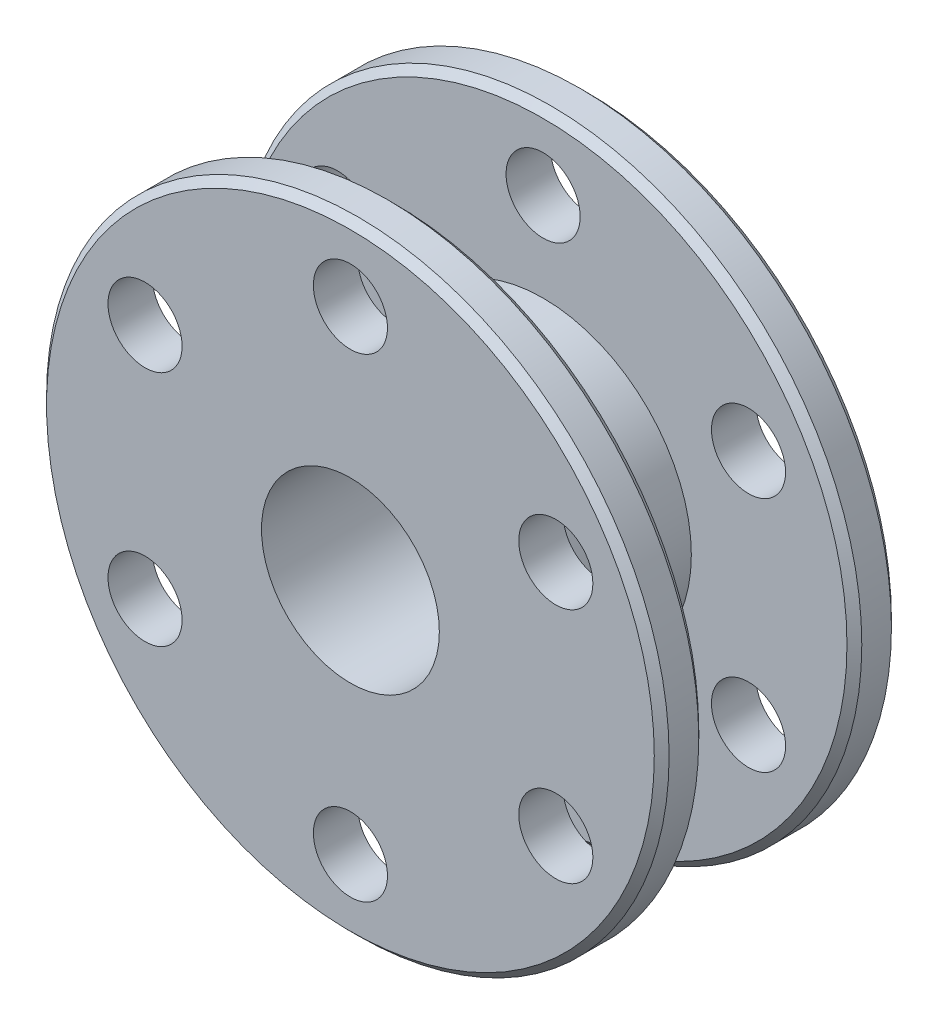
ISO-10303-21;
HEADER;
FILE_DESCRIPTION(('STEP AP214'),'2;1');
FILE_NAME('part.step','',(''),(''),'','','');
FILE_SCHEMA(('AUTOMOTIVE_DESIGN { 1 0 10303 214 1 1 1 1 }'));
ENDSEC;
DATA;
#1=APPLICATION_CONTEXT('core data for automotive mechanical design processes');
#2=APPLICATION_PROTOCOL_DEFINITION('international standard','automotive_design',2000,#1);
#3=PRODUCT_CONTEXT('',#1,'mechanical');
#4=PRODUCT('Part','Part','',(#3));
#5=PRODUCT_RELATED_PRODUCT_CATEGORY('part','',(#4));
#6=PRODUCT_DEFINITION_FORMATION('','',#4);
#7=PRODUCT_DEFINITION_CONTEXT('part definition',#1,'design');
#8=PRODUCT_DEFINITION('design','',#6,#7);
#9=PRODUCT_DEFINITION_SHAPE('','',#8);
#10=(LENGTH_UNIT() NAMED_UNIT(*) SI_UNIT(.MILLI.,.METRE.));
#11=(NAMED_UNIT(*) PLANE_ANGLE_UNIT() SI_UNIT($,.RADIAN.));
#12=(NAMED_UNIT(*) SI_UNIT($,.STERADIAN.) SOLID_ANGLE_UNIT());
#13=UNCERTAINTY_MEASURE_WITH_UNIT(LENGTH_MEASURE(1.E-05),#10,'distance_accuracy_value','');
#14=(GEOMETRIC_REPRESENTATION_CONTEXT(3) GLOBAL_UNCERTAINTY_ASSIGNED_CONTEXT((#13)) GLOBAL_UNIT_ASSIGNED_CONTEXT((#10,
#11,#12)) REPRESENTATION_CONTEXT('',''));
#15=CARTESIAN_POINT('',(0.,0.,0.));
#16=DIRECTION('',(0.,0.,1.));
#17=DIRECTION('',(1.,0.,0.));
#18=AXIS2_PLACEMENT_3D('',#15,#16,#17);
#19=CARTESIAN_POINT('',(0.,0.,-4.));
#20=DIRECTION('',(0.,0.,1.));
#21=DIRECTION('',(1.,0.,0.));
#22=AXIS2_PLACEMENT_3D('',#19,#20,#21);
#23=CYLINDRICAL_SURFACE('',#22,10.5);
#24=CARTESIAN_POINT('',(0.,0.,-2.75));
#25=DIRECTION('',(0.,0.,1.));
#26=DIRECTION('',(1.,0.,0.));
#27=AXIS2_PLACEMENT_3D('',#24,#25,#26);
#28=CIRCLE('',#27,10.5);
#29=CARTESIAN_POINT('',(10.5,0.,-2.75));
#30=VERTEX_POINT('',#29);
#31=EDGE_CURVE('E125',#30,#30,#28,.F.);
#32=ORIENTED_EDGE('',*,*,#31,.T.);
#33=EDGE_LOOP('',(#32));
#34=FACE_BOUND('',#33,.T.);
#35=CARTESIAN_POINT('',(0.,0.,-3.75));
#36=DIRECTION('',(0.,0.,1.));
#37=DIRECTION('',(1.,0.,0.));
#38=AXIS2_PLACEMENT_3D('',#35,#36,#37);
#39=CIRCLE('',#38,10.5);
#40=CARTESIAN_POINT('',(10.5,0.,-3.75));
#41=VERTEX_POINT('',#40);
#42=EDGE_CURVE('E119',#41,#41,#39,.T.);
#43=ORIENTED_EDGE('',*,*,#42,.T.);
#44=EDGE_LOOP('',(#43));
#45=FACE_BOUND('',#44,.T.);
#46=ADVANCED_FACE('F39',(#34,#45),#23,.T.);
#47=CARTESIAN_POINT('',(0.,0.,2.75));
#48=DIRECTION('',(0.,0.,1.));
#49=DIRECTION('',(1.,0.,0.));
#50=AXIS2_PLACEMENT_3D('',#47,#48,#49);
#51=CIRCLE('',#50,10.5);
#52=CARTESIAN_POINT('',(10.5,0.,2.75));
#53=VERTEX_POINT('',#52);
#54=EDGE_CURVE('E11',#53,#53,#51,.T.);
#55=ORIENTED_EDGE('',*,*,#54,.T.);
#56=EDGE_LOOP('',(#55));
#57=FACE_BOUND('',#56,.T.);
#58=CARTESIAN_POINT('',(0.,0.,3.75));
#59=DIRECTION('',(0.,0.,1.));
#60=DIRECTION('',(1.,0.,0.));
#61=AXIS2_PLACEMENT_3D('',#58,#59,#60);
#62=CIRCLE('',#61,10.5);
#63=CARTESIAN_POINT('',(10.5,0.,3.75));
#64=VERTEX_POINT('',#63);
#65=EDGE_CURVE('E116',#64,#64,#62,.F.);
#66=ORIENTED_EDGE('',*,*,#65,.T.);
#67=EDGE_LOOP('',(#66));
#68=FACE_BOUND('',#67,.T.);
#69=ADVANCED_FACE('F141',(#57,#68),#23,.T.);
#70=CARTESIAN_POINT('',(0.,0.,-4.));
#71=DIRECTION('',(0.,0.,1.));
#72=DIRECTION('',(1.,0.,0.));
#73=AXIS2_PLACEMENT_3D('',#70,#71,#72);
#74=PLANE('',#73);
#75=CARTESIAN_POINT('',(0.,8.,-4.));
#76=DIRECTION('',(0.,0.,1.));
#77=DIRECTION('',(1.,0.,0.));
#78=AXIS2_PLACEMENT_3D('',#75,#76,#77);
#79=CIRCLE('',#78,1.25);
#80=CARTESIAN_POINT('',(1.25,8.,-4.));
#81=VERTEX_POINT('',#80);
#82=EDGE_CURVE('E61',#81,#81,#79,.T.);
#83=ORIENTED_EDGE('',*,*,#82,.T.);
#84=EDGE_LOOP('',(#83));
#85=FACE_BOUND('',#84,.T.);
#86=CARTESIAN_POINT('',(-6.92820323027506,3.99999999999921,-4.));
#87=DIRECTION('',(0.,0.,1.));
#88=DIRECTION('',(1.,0.,0.));
#89=AXIS2_PLACEMENT_3D('',#86,#87,#88);
#90=CIRCLE('',#89,1.25000000000076);
#91=CARTESIAN_POINT('',(-5.6782032302743,3.99999999999921,-4.));
#92=VERTEX_POINT('',#91);
#93=EDGE_CURVE('E444',#92,#92,#90,.T.);
#94=ORIENTED_EDGE('',*,*,#93,.T.);
#95=EDGE_LOOP('',(#94));
#96=FACE_BOUND('',#95,.T.);
#97=CARTESIAN_POINT('',(-6.92820323027415,-4.00000000000079,-4.));
#98=DIRECTION('',(0.,0.,1.));
#99=DIRECTION('',(1.,0.,0.));
#100=AXIS2_PLACEMENT_3D('',#97,#98,#99);
#101=CIRCLE('',#100,1.25000000000161);
#102=CARTESIAN_POINT('',(-5.67820323027254,-4.00000000000079,-4.));
#103=VERTEX_POINT('',#102);
#104=EDGE_CURVE('E447',#103,#103,#101,.T.);
#105=ORIENTED_EDGE('',*,*,#104,.T.);
#106=EDGE_LOOP('',(#105));
#107=FACE_BOUND('',#106,.T.);
#108=CARTESIAN_POINT('',(1.8160502512279E-12,-8.,-4.));
#109=DIRECTION('',(0.,0.,1.));
#110=DIRECTION('',(1.,0.,0.));
#111=AXIS2_PLACEMENT_3D('',#108,#109,#110);
#112=CIRCLE('',#111,1.25000000000179);
#113=CARTESIAN_POINT('',(1.25000000000361,-8.,-4.));
#114=VERTEX_POINT('',#113);
#115=EDGE_CURVE('E441',#114,#114,#112,.T.);
#116=ORIENTED_EDGE('',*,*,#115,.T.);
#117=EDGE_LOOP('',(#116));
#118=FACE_BOUND('',#117,.T.);
#119=CARTESIAN_POINT('',(6.92820323027687,-3.99999999999921,-4.));
#120=DIRECTION('',(0.,0.,1.));
#121=DIRECTION('',(1.,0.,0.));
#122=AXIS2_PLACEMENT_3D('',#119,#120,#121);
#123=CIRCLE('',#122,1.25000000000111);
#124=CARTESIAN_POINT('',(8.17820323027798,-3.99999999999921,-4.));
#125=VERTEX_POINT('',#124);
#126=EDGE_CURVE('E436',#125,#125,#123,.T.);
#127=ORIENTED_EDGE('',*,*,#126,.T.);
#128=EDGE_LOOP('',(#127));
#129=FACE_BOUND('',#128,.T.);
#130=CARTESIAN_POINT('',(6.92820323027596,4.00000000000079,-4.));
#131=DIRECTION('',(0.,0.,1.));
#132=DIRECTION('',(1.,0.,0.));
#133=AXIS2_PLACEMENT_3D('',#130,#131,#132);
#134=CIRCLE('',#133,1.25000000000022);
#135=CARTESIAN_POINT('',(8.17820323027619,4.00000000000079,-4.));
#136=VERTEX_POINT('',#135);
#137=EDGE_CURVE('E434',#136,#136,#134,.T.);
#138=ORIENTED_EDGE('',*,*,#137,.T.);
#139=EDGE_LOOP('',(#138));
#140=FACE_BOUND('',#139,.T.);
#141=CARTESIAN_POINT('',(0.,0.,-4.));
#142=DIRECTION('',(0.,0.,1.));
#143=DIRECTION('',(1.,0.,0.));
#144=AXIS2_PLACEMENT_3D('',#141,#142,#143);
#145=CIRCLE('',#144,10.25);
#146=CARTESIAN_POINT('',(10.25,0.,-4.));
#147=VERTEX_POINT('',#146);
#148=EDGE_CURVE('E122',#147,#147,#145,.F.);
#149=ORIENTED_EDGE('',*,*,#148,.T.);
#150=EDGE_LOOP('',(#149));
#151=FACE_BOUND('',#150,.T.);
#152=CARTESIAN_POINT('',(0.,0.,-4.));
#153=DIRECTION('',(0.,0.,1.));
#154=DIRECTION('',(1.,0.,0.));
#155=AXIS2_PLACEMENT_3D('',#152,#153,#154);
#156=CIRCLE('',#155,3.);
#157=CARTESIAN_POINT('',(3.,0.,-4.));
#158=VERTEX_POINT('',#157);
#159=EDGE_CURVE('E110',#158,#158,#156,.T.);
#160=ORIENTED_EDGE('',*,*,#159,.T.);
#161=EDGE_LOOP('',(#160));
#162=FACE_BOUND('',#161,.T.);
#163=ADVANCED_FACE('F174',(#85,#96,#107,#118,#129,#140,#151,#162),#74,.F.);
#164=CARTESIAN_POINT('',(0.,0.,4.));
#165=DIRECTION('',(0.,0.,1.));
#166=DIRECTION('',(1.,0.,0.));
#167=AXIS2_PLACEMENT_3D('',#164,#165,#166);
#168=PLANE('',#167);
#169=CARTESIAN_POINT('',(0.,8.,4.));
#170=DIRECTION('',(0.,0.,1.));
#171=DIRECTION('',(1.,0.,0.));
#172=AXIS2_PLACEMENT_3D('',#169,#170,#171);
#173=CIRCLE('',#172,1.25);
#174=CARTESIAN_POINT('',(1.25,8.,4.));
#175=VERTEX_POINT('',#174);
#176=EDGE_CURVE('E98',#175,#175,#173,.T.);
#177=ORIENTED_EDGE('',*,*,#176,.F.);
#178=EDGE_LOOP('',(#177));
#179=FACE_BOUND('',#178,.T.);
#180=CARTESIAN_POINT('',(-6.92820323027506,3.99999999999921,4.));
#181=DIRECTION('',(0.,0.,1.));
#182=DIRECTION('',(1.,0.,0.));
#183=AXIS2_PLACEMENT_3D('',#180,#181,#182);
#184=CIRCLE('',#183,1.25000000000076);
#185=CARTESIAN_POINT('',(-5.6782032302743,3.99999999999921,4.));
#186=VERTEX_POINT('',#185);
#187=EDGE_CURVE('E83',#186,#186,#184,.T.);
#188=ORIENTED_EDGE('',*,*,#187,.F.);
#189=EDGE_LOOP('',(#188));
#190=FACE_BOUND('',#189,.T.);
#191=CARTESIAN_POINT('',(-6.92820323027415,-4.00000000000079,4.));
#192=DIRECTION('',(0.,0.,1.));
#193=DIRECTION('',(1.,0.,0.));
#194=AXIS2_PLACEMENT_3D('',#191,#192,#193);
#195=CIRCLE('',#194,1.25000000000161);
#196=CARTESIAN_POINT('',(-5.67820323027254,-4.00000000000079,4.));
#197=VERTEX_POINT('',#196);
#198=EDGE_CURVE('E79',#197,#197,#195,.T.);
#199=ORIENTED_EDGE('',*,*,#198,.F.);
#200=EDGE_LOOP('',(#199));
#201=FACE_BOUND('',#200,.T.);
#202=CARTESIAN_POINT('',(1.8160502512279E-12,-8.,4.));
#203=DIRECTION('',(0.,0.,1.));
#204=DIRECTION('',(1.,0.,0.));
#205=AXIS2_PLACEMENT_3D('',#202,#203,#204);
#206=CIRCLE('',#205,1.25000000000179);
#207=CARTESIAN_POINT('',(1.25000000000361,-8.,4.));
#208=VERTEX_POINT('',#207);
#209=EDGE_CURVE('E75',#208,#208,#206,.T.);
#210=ORIENTED_EDGE('',*,*,#209,.F.);
#211=EDGE_LOOP('',(#210));
#212=FACE_BOUND('',#211,.T.);
#213=CARTESIAN_POINT('',(6.92820323027687,-3.99999999999921,4.));
#214=DIRECTION('',(0.,0.,1.));
#215=DIRECTION('',(1.,0.,0.));
#216=AXIS2_PLACEMENT_3D('',#213,#214,#215);
#217=CIRCLE('',#216,1.25000000000111);
#218=CARTESIAN_POINT('',(8.17820323027798,-3.99999999999921,4.));
#219=VERTEX_POINT('',#218);
#220=EDGE_CURVE('E71',#219,#219,#217,.T.);
#221=ORIENTED_EDGE('',*,*,#220,.F.);
#222=EDGE_LOOP('',(#221));
#223=FACE_BOUND('',#222,.T.);
#224=CARTESIAN_POINT('',(6.92820323027596,4.00000000000079,4.));
#225=DIRECTION('',(0.,0.,1.));
#226=DIRECTION('',(1.,0.,0.));
#227=AXIS2_PLACEMENT_3D('',#224,#225,#226);
#228=CIRCLE('',#227,1.25000000000022);
#229=CARTESIAN_POINT('',(8.17820323027619,4.00000000000079,4.));
#230=VERTEX_POINT('',#229);
#231=EDGE_CURVE('E66',#230,#230,#228,.T.);
#232=ORIENTED_EDGE('',*,*,#231,.F.);
#233=EDGE_LOOP('',(#232));
#234=FACE_BOUND('',#233,.T.);
#235=CARTESIAN_POINT('',(0.,0.,4.));
#236=DIRECTION('',(0.,0.,1.));
#237=DIRECTION('',(1.,0.,0.));
#238=AXIS2_PLACEMENT_3D('',#235,#236,#237);
#239=CIRCLE('',#238,10.25);
#240=CARTESIAN_POINT('',(10.25,0.,4.));
#241=VERTEX_POINT('',#240);
#242=EDGE_CURVE('E113',#241,#241,#239,.T.);
#243=ORIENTED_EDGE('',*,*,#242,.T.);
#244=EDGE_LOOP('',(#243));
#245=FACE_BOUND('',#244,.T.);
#246=CARTESIAN_POINT('',(0.,0.,4.));
#247=DIRECTION('',(0.,0.,1.));
#248=DIRECTION('',(1.,0.,0.));
#249=AXIS2_PLACEMENT_3D('',#246,#247,#248);
#250=CIRCLE('',#249,3.);
#251=CARTESIAN_POINT('',(3.,0.,4.));
#252=VERTEX_POINT('',#251);
#253=EDGE_CURVE('E105',#252,#252,#250,.T.);
#254=ORIENTED_EDGE('',*,*,#253,.F.);
#255=EDGE_LOOP('',(#254));
#256=FACE_BOUND('',#255,.T.);
#257=ADVANCED_FACE('F177',(#179,#190,#201,#212,#223,#234,#245,#256),#168,.T.);
#258=CARTESIAN_POINT('',(0.,0.,-6.));
#259=DIRECTION('',(0.,0.,1.));
#260=DIRECTION('',(1.,0.,0.));
#261=AXIS2_PLACEMENT_3D('',#258,#259,#260);
#262=CYLINDRICAL_SURFACE('',#261,3.);
#263=ORIENTED_EDGE('',*,*,#253,.T.);
#264=EDGE_LOOP('',(#263));
#265=FACE_BOUND('',#264,.T.);
#266=ORIENTED_EDGE('',*,*,#159,.F.);
#267=EDGE_LOOP('',(#266));
#268=FACE_BOUND('',#267,.T.);
#269=ADVANCED_FACE('F157',(#265,#268),#262,.F.);
#270=CARTESIAN_POINT('',(0.,0.,4.));
#271=DIRECTION('',(0.,0.,-1.));
#272=DIRECTION('',(-1.,0.,0.));
#273=AXIS2_PLACEMENT_3D('',#270,#271,#272);
#274=CONICAL_SURFACE('',#273,10.25,0.785398163397452);
#275=ORIENTED_EDGE('',*,*,#65,.F.);
#276=EDGE_LOOP('',(#275));
#277=FACE_BOUND('',#276,.T.);
#278=ORIENTED_EDGE('',*,*,#242,.F.);
#279=EDGE_LOOP('',(#278));
#280=FACE_BOUND('',#279,.T.);
#281=ADVANCED_FACE('F147',(#277,#280),#274,.T.);
#282=CARTESIAN_POINT('',(0.,0.,-3.75));
#283=DIRECTION('',(0.,0.,1.));
#284=DIRECTION('',(1.,0.,0.));
#285=AXIS2_PLACEMENT_3D('',#282,#283,#284);
#286=CONICAL_SURFACE('',#285,10.5,0.785398163397448);
#287=ORIENTED_EDGE('',*,*,#148,.F.);
#288=EDGE_LOOP('',(#287));
#289=FACE_BOUND('',#288,.T.);
#290=ORIENTED_EDGE('',*,*,#42,.F.);
#291=EDGE_LOOP('',(#290));
#292=FACE_BOUND('',#291,.T.);
#293=ADVANCED_FACE('F145',(#289,#292),#286,.T.);
#294=CARTESIAN_POINT('',(0.,0.,-2.5));
#295=DIRECTION('',(0.,0.,1.));
#296=DIRECTION('',(1.,0.,0.));
#297=AXIS2_PLACEMENT_3D('',#294,#295,#296);
#298=PLANE('',#297);
#299=CARTESIAN_POINT('',(0.,8.,-2.5));
#300=DIRECTION('',(0.,0.,1.));
#301=DIRECTION('',(1.,0.,0.));
#302=AXIS2_PLACEMENT_3D('',#299,#300,#301);
#303=CIRCLE('',#302,1.25);
#304=CARTESIAN_POINT('',(1.25,8.,-2.5));
#305=VERTEX_POINT('',#304);
#306=EDGE_CURVE('E95',#305,#305,#303,.T.);
#307=ORIENTED_EDGE('',*,*,#306,.F.);
#308=EDGE_LOOP('',(#307));
#309=FACE_BOUND('',#308,.T.);
#310=CARTESIAN_POINT('',(-6.92820323027506,3.99999999999921,-2.5));
#311=DIRECTION('',(0.,0.,1.));
#312=DIRECTION('',(1.,0.,0.));
#313=AXIS2_PLACEMENT_3D('',#310,#311,#312);
#314=CIRCLE('',#313,1.25000000000076);
#315=CARTESIAN_POINT('',(-5.6782032302743,3.99999999999921,-2.5));
#316=VERTEX_POINT('',#315);
#317=EDGE_CURVE('E78',#316,#316,#314,.T.);
#318=ORIENTED_EDGE('',*,*,#317,.F.);
#319=EDGE_LOOP('',(#318));
#320=FACE_BOUND('',#319,.T.);
#321=CARTESIAN_POINT('',(-6.92820323027415,-4.00000000000079,-2.5));
#322=DIRECTION('',(0.,0.,1.));
#323=DIRECTION('',(1.,0.,0.));
#324=AXIS2_PLACEMENT_3D('',#321,#322,#323);
#325=CIRCLE('',#324,1.25000000000161);
#326=CARTESIAN_POINT('',(-5.67820323027254,-4.00000000000079,-2.5));
#327=VERTEX_POINT('',#326);
#328=EDGE_CURVE('E74',#327,#327,#325,.T.);
#329=ORIENTED_EDGE('',*,*,#328,.F.);
#330=EDGE_LOOP('',(#329));
#331=FACE_BOUND('',#330,.T.);
#332=CARTESIAN_POINT('',(1.8160502512279E-12,-8.,-2.5));
#333=DIRECTION('',(0.,0.,1.));
#334=DIRECTION('',(1.,0.,0.));
#335=AXIS2_PLACEMENT_3D('',#332,#333,#334);
#336=CIRCLE('',#335,1.25000000000179);
#337=CARTESIAN_POINT('',(1.25000000000361,-8.,-2.5));
#338=VERTEX_POINT('',#337);
#339=EDGE_CURVE('E70',#338,#338,#336,.T.);
#340=ORIENTED_EDGE('',*,*,#339,.F.);
#341=EDGE_LOOP('',(#340));
#342=FACE_BOUND('',#341,.T.);
#343=CARTESIAN_POINT('',(6.92820323027687,-3.99999999999921,-2.5));
#344=DIRECTION('',(0.,0.,1.));
#345=DIRECTION('',(1.,0.,0.));
#346=AXIS2_PLACEMENT_3D('',#343,#344,#345);
#347=CIRCLE('',#346,1.25000000000111);
#348=CARTESIAN_POINT('',(8.17820323027798,-3.99999999999921,-2.5));
#349=VERTEX_POINT('',#348);
#350=EDGE_CURVE('E65',#349,#349,#347,.T.);
#351=ORIENTED_EDGE('',*,*,#350,.F.);
#352=EDGE_LOOP('',(#351));
#353=FACE_BOUND('',#352,.T.);
#354=CARTESIAN_POINT('',(6.92820323027596,4.00000000000079,-2.5));
#355=DIRECTION('',(0.,0.,1.));
#356=DIRECTION('',(1.,0.,0.));
#357=AXIS2_PLACEMENT_3D('',#354,#355,#356);
#358=CIRCLE('',#357,1.25000000000022);
#359=CARTESIAN_POINT('',(8.17820323027619,4.00000000000079,-2.5));
#360=VERTEX_POINT('',#359);
#361=EDGE_CURVE('E60',#360,#360,#358,.T.);
#362=ORIENTED_EDGE('',*,*,#361,.F.);
#363=EDGE_LOOP('',(#362));
#364=FACE_BOUND('',#363,.T.);
#365=CARTESIAN_POINT('',(0.,0.,-2.5));
#366=DIRECTION('',(0.,0.,1.));
#367=DIRECTION('',(1.,0.,0.));
#368=AXIS2_PLACEMENT_3D('',#365,#366,#367);
#369=CIRCLE('',#368,10.25);
#370=CARTESIAN_POINT('',(10.25,0.,-2.5));
#371=VERTEX_POINT('',#370);
#372=EDGE_CURVE('E53',#371,#371,#369,.T.);
#373=ORIENTED_EDGE('',*,*,#372,.T.);
#374=EDGE_LOOP('',(#373));
#375=FACE_BOUND('',#374,.T.);
#376=CARTESIAN_POINT('',(0.,0.,-2.5));
#377=DIRECTION('',(0.,0.,1.));
#378=DIRECTION('',(1.,0.,0.));
#379=AXIS2_PLACEMENT_3D('',#376,#377,#378);
#380=CIRCLE('',#379,5.);
#381=CARTESIAN_POINT('',(5.,0.,-2.5));
#382=VERTEX_POINT('',#381);
#383=EDGE_CURVE('E102',#382,#382,#380,.T.);
#384=ORIENTED_EDGE('',*,*,#383,.F.);
#385=EDGE_LOOP('',(#384));
#386=FACE_BOUND('',#385,.T.);
#387=ADVANCED_FACE('F130',(#309,#320,#331,#342,#353,#364,#375,#386),#298,.T.);
#388=CARTESIAN_POINT('',(0.,0.,2.5));
#389=DIRECTION('',(0.,0.,1.));
#390=DIRECTION('',(1.,0.,0.));
#391=AXIS2_PLACEMENT_3D('',#388,#389,#390);
#392=PLANE('',#391);
#393=CARTESIAN_POINT('',(0.,8.,2.5));
#394=DIRECTION('',(0.,0.,1.));
#395=DIRECTION('',(1.,0.,0.));
#396=AXIS2_PLACEMENT_3D('',#393,#394,#395);
#397=CIRCLE('',#396,1.25);
#398=CARTESIAN_POINT('',(1.25,8.,2.5));
#399=VERTEX_POINT('',#398);
#400=EDGE_CURVE('E44',#399,#399,#397,.T.);
#401=ORIENTED_EDGE('',*,*,#400,.T.);
#402=EDGE_LOOP('',(#401));
#403=FACE_BOUND('',#402,.T.);
#404=CARTESIAN_POINT('',(-6.92820323027506,3.99999999999921,2.5));
#405=DIRECTION('',(0.,0.,1.));
#406=DIRECTION('',(1.,0.,0.));
#407=AXIS2_PLACEMENT_3D('',#404,#405,#406);
#408=CIRCLE('',#407,1.25000000000076);
#409=CARTESIAN_POINT('',(-5.6782032302743,3.99999999999921,2.5));
#410=VERTEX_POINT('',#409);
#411=EDGE_CURVE('E76',#410,#410,#408,.T.);
#412=ORIENTED_EDGE('',*,*,#411,.T.);
#413=EDGE_LOOP('',(#412));
#414=FACE_BOUND('',#413,.T.);
#415=CARTESIAN_POINT('',(-6.92820323027415,-4.00000000000079,2.5));
#416=DIRECTION('',(0.,0.,1.));
#417=DIRECTION('',(1.,0.,0.));
#418=AXIS2_PLACEMENT_3D('',#415,#416,#417);
#419=CIRCLE('',#418,1.25000000000161);
#420=CARTESIAN_POINT('',(-5.67820323027254,-4.00000000000079,2.5));
#421=VERTEX_POINT('',#420);
#422=EDGE_CURVE('E72',#421,#421,#419,.T.);
#423=ORIENTED_EDGE('',*,*,#422,.T.);
#424=EDGE_LOOP('',(#423));
#425=FACE_BOUND('',#424,.T.);
#426=CARTESIAN_POINT('',(1.8160502512279E-12,-8.,2.5));
#427=DIRECTION('',(0.,0.,1.));
#428=DIRECTION('',(1.,0.,0.));
#429=AXIS2_PLACEMENT_3D('',#426,#427,#428);
#430=CIRCLE('',#429,1.25000000000179);
#431=CARTESIAN_POINT('',(1.25000000000361,-8.,2.5));
#432=VERTEX_POINT('',#431);
#433=EDGE_CURVE('E67',#432,#432,#430,.T.);
#434=ORIENTED_EDGE('',*,*,#433,.T.);
#435=EDGE_LOOP('',(#434));
#436=FACE_BOUND('',#435,.T.);
#437=CARTESIAN_POINT('',(6.92820323027687,-3.99999999999921,2.5));
#438=DIRECTION('',(0.,0.,1.));
#439=DIRECTION('',(1.,0.,0.));
#440=AXIS2_PLACEMENT_3D('',#437,#438,#439);
#441=CIRCLE('',#440,1.25000000000111);
#442=CARTESIAN_POINT('',(8.17820323027798,-3.99999999999921,2.5));
#443=VERTEX_POINT('',#442);
#444=EDGE_CURVE('E62',#443,#443,#441,.T.);
#445=ORIENTED_EDGE('',*,*,#444,.T.);
#446=EDGE_LOOP('',(#445));
#447=FACE_BOUND('',#446,.T.);
#448=CARTESIAN_POINT('',(6.92820323027596,4.00000000000079,2.5));
#449=DIRECTION('',(0.,0.,1.));
#450=DIRECTION('',(1.,0.,0.));
#451=AXIS2_PLACEMENT_3D('',#448,#449,#450);
#452=CIRCLE('',#451,1.25000000000022);
#453=CARTESIAN_POINT('',(8.17820323027619,4.00000000000079,2.5));
#454=VERTEX_POINT('',#453);
#455=EDGE_CURVE('E57',#454,#454,#452,.T.);
#456=ORIENTED_EDGE('',*,*,#455,.T.);
#457=EDGE_LOOP('',(#456));
#458=FACE_BOUND('',#457,.T.);
#459=CARTESIAN_POINT('',(0.,0.,2.5));
#460=DIRECTION('',(0.,0.,1.));
#461=DIRECTION('',(1.,0.,0.));
#462=AXIS2_PLACEMENT_3D('',#459,#460,#461);
#463=CIRCLE('',#462,10.25);
#464=CARTESIAN_POINT('',(10.25,0.,2.5));
#465=VERTEX_POINT('',#464);
#466=EDGE_CURVE('E48',#465,#465,#463,.F.);
#467=ORIENTED_EDGE('',*,*,#466,.T.);
#468=EDGE_LOOP('',(#467));
#469=FACE_BOUND('',#468,.T.);
#470=CARTESIAN_POINT('',(0.,0.,2.5));
#471=DIRECTION('',(0.,0.,1.));
#472=DIRECTION('',(1.,0.,0.));
#473=AXIS2_PLACEMENT_3D('',#470,#471,#472);
#474=CIRCLE('',#473,5.);
#475=CARTESIAN_POINT('',(5.,0.,2.5));
#476=VERTEX_POINT('',#475);
#477=EDGE_CURVE('E101',#476,#476,#474,.T.);
#478=ORIENTED_EDGE('',*,*,#477,.T.);
#479=EDGE_LOOP('',(#478));
#480=FACE_BOUND('',#479,.T.);
#481=ADVANCED_FACE('F154',(#403,#414,#425,#436,#447,#458,#469,#480),#392,.F.);
#482=CARTESIAN_POINT('',(0.,0.,-2.5));
#483=DIRECTION('',(0.,0.,1.));
#484=DIRECTION('',(1.,0.,0.));
#485=AXIS2_PLACEMENT_3D('',#482,#483,#484);
#486=CYLINDRICAL_SURFACE('',#485,5.);
#487=ORIENTED_EDGE('',*,*,#383,.T.);
#488=EDGE_LOOP('',(#487));
#489=FACE_BOUND('',#488,.T.);
#490=ORIENTED_EDGE('',*,*,#477,.F.);
#491=EDGE_LOOP('',(#490));
#492=FACE_BOUND('',#491,.T.);
#493=ADVANCED_FACE('F136',(#489,#492),#486,.T.);
#494=CARTESIAN_POINT('',(0.,0.,-2.75));
#495=DIRECTION('',(0.,0.,-1.));
#496=DIRECTION('',(-1.,0.,0.));
#497=AXIS2_PLACEMENT_3D('',#494,#495,#496);
#498=CONICAL_SURFACE('',#497,10.5,0.785398163397448);
#499=ORIENTED_EDGE('',*,*,#372,.F.);
#500=EDGE_LOOP('',(#499));
#501=FACE_BOUND('',#500,.T.);
#502=ORIENTED_EDGE('',*,*,#31,.F.);
#503=EDGE_LOOP('',(#502));
#504=FACE_BOUND('',#503,.T.);
#505=ADVANCED_FACE('F133',(#501,#504),#498,.T.);
#506=CARTESIAN_POINT('',(0.,0.,2.5));
#507=DIRECTION('',(0.,0.,1.));
#508=DIRECTION('',(1.,0.,0.));
#509=AXIS2_PLACEMENT_3D('',#506,#507,#508);
#510=CONICAL_SURFACE('',#509,10.25,0.785398163397438);
#511=ORIENTED_EDGE('',*,*,#54,.F.);
#512=EDGE_LOOP('',(#511));
#513=FACE_BOUND('',#512,.T.);
#514=ORIENTED_EDGE('',*,*,#466,.F.);
#515=EDGE_LOOP('',(#514));
#516=FACE_BOUND('',#515,.T.);
#517=ADVANCED_FACE('F42',(#513,#516),#510,.T.);
#518=CARTESIAN_POINT('',(6.92820323027596,4.00000000000079,-4.));
#519=DIRECTION('',(0.,0.,1.));
#520=DIRECTION('',(1.,0.,0.));
#521=AXIS2_PLACEMENT_3D('',#518,#519,#520);
#522=CYLINDRICAL_SURFACE('',#521,1.25000000000022);
#523=ORIENTED_EDGE('',*,*,#231,.T.);
#524=EDGE_LOOP('',(#523));
#525=FACE_BOUND('',#524,.T.);
#526=ORIENTED_EDGE('',*,*,#455,.F.);
#527=EDGE_LOOP('',(#526));
#528=FACE_BOUND('',#527,.T.);
#529=ADVANCED_FACE('F212',(#525,#528),#522,.F.);
#530=CARTESIAN_POINT('',(6.92820323027687,-3.99999999999921,-4.));
#531=DIRECTION('',(0.,0.,1.));
#532=DIRECTION('',(1.,0.,0.));
#533=AXIS2_PLACEMENT_3D('',#530,#531,#532);
#534=CYLINDRICAL_SURFACE('',#533,1.25000000000111);
#535=ORIENTED_EDGE('',*,*,#220,.T.);
#536=EDGE_LOOP('',(#535));
#537=FACE_BOUND('',#536,.T.);
#538=ORIENTED_EDGE('',*,*,#444,.F.);
#539=EDGE_LOOP('',(#538));
#540=FACE_BOUND('',#539,.T.);
#541=ADVANCED_FACE('F207',(#537,#540),#534,.F.);
#542=CARTESIAN_POINT('',(1.8160502512279E-12,-8.,-4.));
#543=DIRECTION('',(0.,0.,1.));
#544=DIRECTION('',(1.,0.,0.));
#545=AXIS2_PLACEMENT_3D('',#542,#543,#544);
#546=CYLINDRICAL_SURFACE('',#545,1.25000000000179);
#547=ORIENTED_EDGE('',*,*,#209,.T.);
#548=EDGE_LOOP('',(#547));
#549=FACE_BOUND('',#548,.T.);
#550=ORIENTED_EDGE('',*,*,#433,.F.);
#551=EDGE_LOOP('',(#550));
#552=FACE_BOUND('',#551,.T.);
#553=ADVANCED_FACE('F202',(#549,#552),#546,.F.);
#554=CARTESIAN_POINT('',(-6.92820323027415,-4.00000000000079,-4.));
#555=DIRECTION('',(0.,0.,1.));
#556=DIRECTION('',(1.,0.,0.));
#557=AXIS2_PLACEMENT_3D('',#554,#555,#556);
#558=CYLINDRICAL_SURFACE('',#557,1.25000000000161);
#559=ORIENTED_EDGE('',*,*,#198,.T.);
#560=EDGE_LOOP('',(#559));
#561=FACE_BOUND('',#560,.T.);
#562=ORIENTED_EDGE('',*,*,#422,.F.);
#563=EDGE_LOOP('',(#562));
#564=FACE_BOUND('',#563,.T.);
#565=ADVANCED_FACE('F197',(#561,#564),#558,.F.);
#566=CARTESIAN_POINT('',(-6.92820323027506,3.99999999999921,-4.));
#567=DIRECTION('',(0.,0.,1.));
#568=DIRECTION('',(1.,0.,0.));
#569=AXIS2_PLACEMENT_3D('',#566,#567,#568);
#570=CYLINDRICAL_SURFACE('',#569,1.25000000000076);
#571=ORIENTED_EDGE('',*,*,#187,.T.);
#572=EDGE_LOOP('',(#571));
#573=FACE_BOUND('',#572,.T.);
#574=ORIENTED_EDGE('',*,*,#411,.F.);
#575=EDGE_LOOP('',(#574));
#576=FACE_BOUND('',#575,.T.);
#577=ADVANCED_FACE('F217',(#573,#576),#570,.F.);
#578=CARTESIAN_POINT('',(0.,8.,-4.));
#579=DIRECTION('',(0.,0.,1.));
#580=DIRECTION('',(1.,0.,0.));
#581=AXIS2_PLACEMENT_3D('',#578,#579,#580);
#582=CYLINDRICAL_SURFACE('',#581,1.25);
#583=ORIENTED_EDGE('',*,*,#176,.T.);
#584=EDGE_LOOP('',(#583));
#585=FACE_BOUND('',#584,.T.);
#586=ORIENTED_EDGE('',*,*,#400,.F.);
#587=EDGE_LOOP('',(#586));
#588=FACE_BOUND('',#587,.T.);
#589=ADVANCED_FACE('F210',(#585,#588),#582,.F.);
#590=ORIENTED_EDGE('',*,*,#361,.T.);
#591=EDGE_LOOP('',(#590));
#592=FACE_BOUND('',#591,.T.);
#593=ORIENTED_EDGE('',*,*,#137,.F.);
#594=EDGE_LOOP('',(#593));
#595=FACE_BOUND('',#594,.T.);
#596=ADVANCED_FACE('F205',(#592,#595),#522,.F.);
#597=ORIENTED_EDGE('',*,*,#350,.T.);
#598=EDGE_LOOP('',(#597));
#599=FACE_BOUND('',#598,.T.);
#600=ORIENTED_EDGE('',*,*,#126,.F.);
#601=EDGE_LOOP('',(#600));
#602=FACE_BOUND('',#601,.T.);
#603=ADVANCED_FACE('F200',(#599,#602),#534,.F.);
#604=ORIENTED_EDGE('',*,*,#339,.T.);
#605=EDGE_LOOP('',(#604));
#606=FACE_BOUND('',#605,.T.);
#607=ORIENTED_EDGE('',*,*,#115,.F.);
#608=EDGE_LOOP('',(#607));
#609=FACE_BOUND('',#608,.T.);
#610=ADVANCED_FACE('F195',(#606,#609),#546,.F.);
#611=ORIENTED_EDGE('',*,*,#328,.T.);
#612=EDGE_LOOP('',(#611));
#613=FACE_BOUND('',#612,.T.);
#614=ORIENTED_EDGE('',*,*,#104,.F.);
#615=EDGE_LOOP('',(#614));
#616=FACE_BOUND('',#615,.T.);
#617=ADVANCED_FACE('F191',(#613,#616),#558,.F.);
#618=ORIENTED_EDGE('',*,*,#317,.T.);
#619=EDGE_LOOP('',(#618));
#620=FACE_BOUND('',#619,.T.);
#621=ORIENTED_EDGE('',*,*,#93,.F.);
#622=EDGE_LOOP('',(#621));
#623=FACE_BOUND('',#622,.T.);
#624=ADVANCED_FACE('F194',(#620,#623),#570,.F.);
#625=ORIENTED_EDGE('',*,*,#306,.T.);
#626=EDGE_LOOP('',(#625));
#627=FACE_BOUND('',#626,.T.);
#628=ORIENTED_EDGE('',*,*,#82,.F.);
#629=EDGE_LOOP('',(#628));
#630=FACE_BOUND('',#629,.T.);
#631=ADVANCED_FACE('F215',(#627,#630),#582,.F.);
#632=CLOSED_SHELL('',(#46,#69,#163,#257,#269,#281,#293,#387,#481,#493,#505,#517,#529,#541,#553,
#565,#577,#589,#596,#603,#610,#617,#624,#631));
#633=MANIFOLD_SOLID_BREP('B2',#632);
#634=ADVANCED_BREP_SHAPE_REPRESENTATION('',(#18,#633),#14);
#635=SHAPE_DEFINITION_REPRESENTATION(#9,#634);
ENDSEC;
END-ISO-10303-21;
